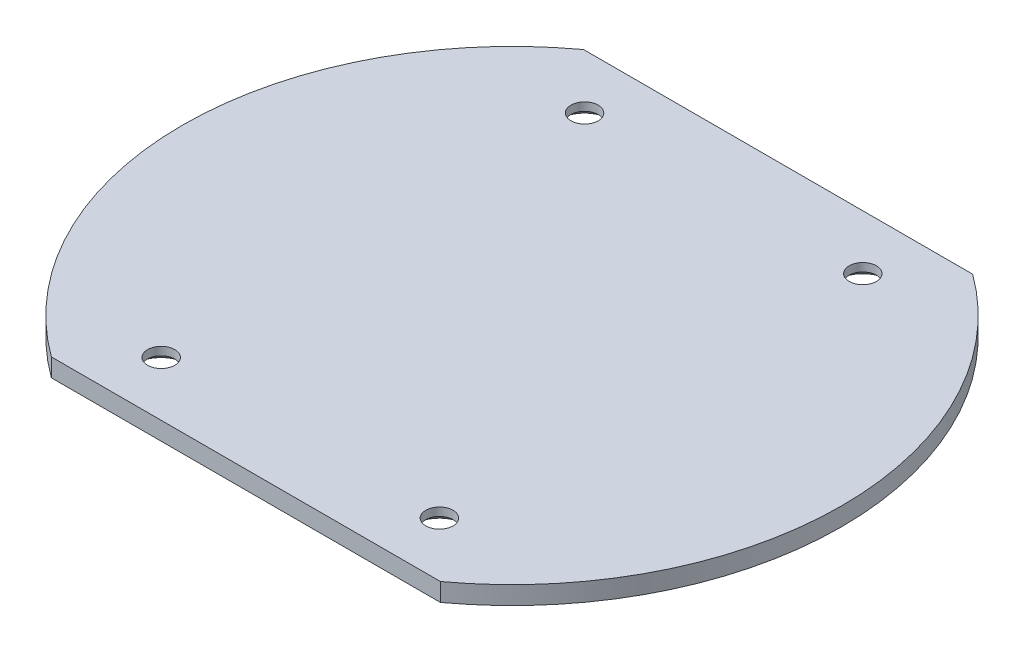
ISO-10303-21;
HEADER;
FILE_DESCRIPTION(('STEP AP214'),'2;1');
FILE_NAME('part.step','',(''),(''),'','','');
FILE_SCHEMA(('AUTOMOTIVE_DESIGN { 1 0 10303 214 1 1 1 1 }'));
ENDSEC;
DATA;
#1=APPLICATION_CONTEXT('core data for automotive mechanical design processes');
#2=APPLICATION_PROTOCOL_DEFINITION('international standard','automotive_design',2000,#1);
#3=PRODUCT_CONTEXT('',#1,'mechanical');
#4=PRODUCT('Part','Part','',(#3));
#5=PRODUCT_RELATED_PRODUCT_CATEGORY('part','',(#4));
#6=PRODUCT_DEFINITION_FORMATION('','',#4);
#7=PRODUCT_DEFINITION_CONTEXT('part definition',#1,'design');
#8=PRODUCT_DEFINITION('design','',#6,#7);
#9=PRODUCT_DEFINITION_SHAPE('','',#8);
#10=(LENGTH_UNIT() NAMED_UNIT(*) SI_UNIT(.MILLI.,.METRE.));
#11=(NAMED_UNIT(*) PLANE_ANGLE_UNIT() SI_UNIT($,.RADIAN.));
#12=(NAMED_UNIT(*) SI_UNIT($,.STERADIAN.) SOLID_ANGLE_UNIT());
#13=UNCERTAINTY_MEASURE_WITH_UNIT(LENGTH_MEASURE(1.E-05),#10,'distance_accuracy_value','');
#14=(GEOMETRIC_REPRESENTATION_CONTEXT(3) GLOBAL_UNCERTAINTY_ASSIGNED_CONTEXT((#13)) GLOBAL_UNIT_ASSIGNED_CONTEXT((#10,
#11,#12)) REPRESENTATION_CONTEXT('',''));
#15=CARTESIAN_POINT('',(0.,0.,0.));
#16=DIRECTION('',(0.,0.,1.));
#17=DIRECTION('',(1.,0.,0.));
#18=AXIS2_PLACEMENT_3D('',#15,#16,#17);
#19=CARTESIAN_POINT('',(0.,3.,0.));
#20=DIRECTION('',(0.,1.,0.));
#21=DIRECTION('',(0.,0.,1.));
#22=AXIS2_PLACEMENT_3D('',#19,#20,#21);
#23=PLANE('',#22);
#24=CARTESIAN_POINT('',(-23.,3.,-35.));
#25=DIRECTION('',(0.,1.,0.));
#26=DIRECTION('',(0.,0.,1.));
#27=AXIS2_PLACEMENT_3D('',#24,#25,#26);
#28=CIRCLE('',#27,2.2479);
#29=CARTESIAN_POINT('',(-23.,3.,-32.7521));
#30=VERTEX_POINT('',#29);
#31=EDGE_CURVE('E113',#30,#30,#28,.T.);
#32=ORIENTED_EDGE('',*,*,#31,.F.);
#33=EDGE_LOOP('',(#32));
#34=FACE_BOUND('',#33,.T.);
#35=CARTESIAN_POINT('',(23.,3.,-35.));
#36=DIRECTION('',(0.,1.,0.));
#37=DIRECTION('',(0.,0.,1.));
#38=AXIS2_PLACEMENT_3D('',#35,#36,#37);
#39=CIRCLE('',#38,2.2479);
#40=CARTESIAN_POINT('',(23.,3.,-32.7521));
#41=VERTEX_POINT('',#40);
#42=EDGE_CURVE('E117',#41,#41,#39,.T.);
#43=ORIENTED_EDGE('',*,*,#42,.F.);
#44=EDGE_LOOP('',(#43));
#45=FACE_BOUND('',#44,.T.);
#46=CARTESIAN_POINT('',(23.,3.,35.));
#47=DIRECTION('',(0.,1.,0.));
#48=DIRECTION('',(0.,0.,1.));
#49=AXIS2_PLACEMENT_3D('',#46,#47,#48);
#50=CIRCLE('',#49,2.2479);
#51=CARTESIAN_POINT('',(23.,3.,37.2479));
#52=VERTEX_POINT('',#51);
#53=EDGE_CURVE('E46',#52,#52,#50,.T.);
#54=ORIENTED_EDGE('',*,*,#53,.F.);
#55=EDGE_LOOP('',(#54));
#56=FACE_BOUND('',#55,.T.);
#57=CARTESIAN_POINT('',(-23.,3.,35.));
#58=DIRECTION('',(0.,1.,0.));
#59=DIRECTION('',(0.,0.,1.));
#60=AXIS2_PLACEMENT_3D('',#57,#58,#59);
#61=CIRCLE('',#60,2.2479);
#62=CARTESIAN_POINT('',(-23.,3.,37.2479));
#63=VERTEX_POINT('',#62);
#64=EDGE_CURVE('E11',#63,#63,#61,.T.);
#65=ORIENTED_EDGE('',*,*,#64,.F.);
#66=EDGE_LOOP('',(#65));
#67=FACE_BOUND('',#66,.T.);
#68=DIRECTION('',(1.,0.,0.));
#69=VECTOR('',#68,1.);
#70=CARTESIAN_POINT('',(0.,3.,44.));
#71=LINE('',#70,#69);
#72=CARTESIAN_POINT('',(-32.159757461772,3.,44.));
#73=VERTEX_POINT('',#72);
#74=CARTESIAN_POINT('',(32.159757461772,3.,44.));
#75=VERTEX_POINT('',#74);
#76=EDGE_CURVE('E100',#73,#75,#71,.T.);
#77=ORIENTED_EDGE('',*,*,#76,.T.);
#78=CARTESIAN_POINT('',(0.,3.,0.));
#79=DIRECTION('',(0.,1.,0.));
#80=DIRECTION('',(0.,0.,1.));
#81=AXIS2_PLACEMENT_3D('',#78,#79,#80);
#82=CIRCLE('',#81,54.5);
#83=CARTESIAN_POINT('',(32.159757461772,3.,-44.));
#84=VERTEX_POINT('',#83);
#85=EDGE_CURVE('E134',#75,#84,#82,.T.);
#86=ORIENTED_EDGE('',*,*,#85,.T.);
#87=DIRECTION('',(-1.,0.,0.));
#88=VECTOR('',#87,1.);
#89=CARTESIAN_POINT('',(0.,3.,-44.));
#90=LINE('',#89,#88);
#91=CARTESIAN_POINT('',(-32.159757461772,3.,-44.));
#92=VERTEX_POINT('',#91);
#93=EDGE_CURVE('E139',#84,#92,#90,.T.);
#94=ORIENTED_EDGE('',*,*,#93,.T.);
#95=CARTESIAN_POINT('',(0.,3.,0.));
#96=DIRECTION('',(0.,1.,0.));
#97=DIRECTION('',(0.,0.,1.));
#98=AXIS2_PLACEMENT_3D('',#95,#96,#97);
#99=CIRCLE('',#98,54.5);
#100=EDGE_CURVE('E94',#92,#73,#99,.T.);
#101=ORIENTED_EDGE('',*,*,#100,.T.);
#102=EDGE_LOOP('',(#77,#86,#94,#101));
#103=FACE_BOUND('',#102,.T.);
#104=ADVANCED_FACE('F36',(#34,#45,#56,#67,#103),#23,.T.);
#105=CARTESIAN_POINT('',(0.,0.,0.));
#106=DIRECTION('',(0.,1.,0.));
#107=DIRECTION('',(0.,0.,1.));
#108=AXIS2_PLACEMENT_3D('',#105,#106,#107);
#109=PLANE('',#108);
#110=CARTESIAN_POINT('',(-23.,0.,35.));
#111=DIRECTION('',(0.,-1.,0.));
#112=DIRECTION('',(0.,0.,-1.));
#113=AXIS2_PLACEMENT_3D('',#110,#111,#112);
#114=CIRCLE('',#113,4.2164);
#115=CARTESIAN_POINT('',(-23.,0.,30.7836));
#116=VERTEX_POINT('',#115);
#117=EDGE_CURVE('E177',#116,#116,#114,.T.);
#118=ORIENTED_EDGE('',*,*,#117,.F.);
#119=EDGE_LOOP('',(#118));
#120=FACE_BOUND('',#119,.T.);
#121=CARTESIAN_POINT('',(23.,0.,35.));
#122=DIRECTION('',(0.,-1.,0.));
#123=DIRECTION('',(0.,0.,-1.));
#124=AXIS2_PLACEMENT_3D('',#121,#122,#123);
#125=CIRCLE('',#124,4.2164);
#126=CARTESIAN_POINT('',(23.,0.,30.7836));
#127=VERTEX_POINT('',#126);
#128=EDGE_CURVE('E157',#127,#127,#125,.T.);
#129=ORIENTED_EDGE('',*,*,#128,.F.);
#130=EDGE_LOOP('',(#129));
#131=FACE_BOUND('',#130,.T.);
#132=CARTESIAN_POINT('',(23.,0.,-35.));
#133=DIRECTION('',(0.,-1.,0.));
#134=DIRECTION('',(0.,0.,-1.));
#135=AXIS2_PLACEMENT_3D('',#132,#133,#134);
#136=CIRCLE('',#135,4.2164);
#137=CARTESIAN_POINT('',(23.,0.,-39.2164));
#138=VERTEX_POINT('',#137);
#139=EDGE_CURVE('E152',#138,#138,#136,.T.);
#140=ORIENTED_EDGE('',*,*,#139,.F.);
#141=EDGE_LOOP('',(#140));
#142=FACE_BOUND('',#141,.T.);
#143=CARTESIAN_POINT('',(-23.,0.,-35.));
#144=DIRECTION('',(0.,-1.,0.));
#145=DIRECTION('',(0.,0.,-1.));
#146=AXIS2_PLACEMENT_3D('',#143,#144,#145);
#147=CIRCLE('',#146,4.2164);
#148=CARTESIAN_POINT('',(-23.,0.,-39.2164));
#149=VERTEX_POINT('',#148);
#150=EDGE_CURVE('E147',#149,#149,#147,.T.);
#151=ORIENTED_EDGE('',*,*,#150,.F.);
#152=EDGE_LOOP('',(#151));
#153=FACE_BOUND('',#152,.T.);
#154=DIRECTION('',(-1.,0.,0.));
#155=VECTOR('',#154,1.);
#156=CARTESIAN_POINT('',(0.,0.,44.));
#157=LINE('',#156,#155);
#158=CARTESIAN_POINT('',(32.159757461772,0.,44.));
#159=VERTEX_POINT('',#158);
#160=CARTESIAN_POINT('',(-32.159757461772,0.,44.));
#161=VERTEX_POINT('',#160);
#162=EDGE_CURVE('E75',#159,#161,#157,.T.);
#163=ORIENTED_EDGE('',*,*,#162,.T.);
#164=CARTESIAN_POINT('',(0.,0.,0.));
#165=DIRECTION('',(0.,1.,0.));
#166=DIRECTION('',(0.,0.,1.));
#167=AXIS2_PLACEMENT_3D('',#164,#165,#166);
#168=CIRCLE('',#167,54.5);
#169=CARTESIAN_POINT('',(-32.159757461772,0.,-44.));
#170=VERTEX_POINT('',#169);
#171=EDGE_CURVE('E77',#161,#170,#168,.F.);
#172=ORIENTED_EDGE('',*,*,#171,.T.);
#173=DIRECTION('',(1.,0.,0.));
#174=VECTOR('',#173,1.);
#175=CARTESIAN_POINT('',(0.,0.,-44.));
#176=LINE('',#175,#174);
#177=CARTESIAN_POINT('',(32.159757461772,0.,-44.));
#178=VERTEX_POINT('',#177);
#179=EDGE_CURVE('E79',#170,#178,#176,.T.);
#180=ORIENTED_EDGE('',*,*,#179,.T.);
#181=CARTESIAN_POINT('',(0.,0.,0.));
#182=DIRECTION('',(0.,1.,0.));
#183=DIRECTION('',(0.,0.,1.));
#184=AXIS2_PLACEMENT_3D('',#181,#182,#183);
#185=CIRCLE('',#184,54.5);
#186=EDGE_CURVE('E54',#178,#159,#185,.F.);
#187=ORIENTED_EDGE('',*,*,#186,.T.);
#188=EDGE_LOOP('',(#163,#172,#180,#187));
#189=FACE_BOUND('',#188,.T.);
#190=ADVANCED_FACE('F38',(#120,#131,#142,#153,#189),#109,.F.);
#191=CARTESIAN_POINT('',(-23.,3.,35.));
#192=DIRECTION('',(0.,1.,0.));
#193=DIRECTION('',(0.,0.,1.));
#194=AXIS2_PLACEMENT_3D('',#191,#192,#193);
#195=CYLINDRICAL_SURFACE('',#194,2.2479);
#196=CARTESIAN_POINT('',(-23.,1.65176762397248,35.));
#197=DIRECTION('',(0.,-1.,0.));
#198=DIRECTION('',(0.,0.,-1.));
#199=AXIS2_PLACEMENT_3D('',#196,#197,#198);
#200=CIRCLE('',#199,2.2479);
#201=CARTESIAN_POINT('',(-23.,1.65176762397248,32.7521));
#202=VERTEX_POINT('',#201);
#203=EDGE_CURVE('E144',#202,#202,#200,.T.);
#204=ORIENTED_EDGE('',*,*,#203,.T.);
#205=EDGE_LOOP('',(#204));
#206=FACE_BOUND('',#205,.T.);
#207=ORIENTED_EDGE('',*,*,#64,.T.);
#208=EDGE_LOOP('',(#207));
#209=FACE_BOUND('',#208,.T.);
#210=ADVANCED_FACE('F186',(#206,#209),#195,.F.);
#211=CARTESIAN_POINT('',(23.,3.,35.));
#212=DIRECTION('',(0.,1.,0.));
#213=DIRECTION('',(0.,0.,1.));
#214=AXIS2_PLACEMENT_3D('',#211,#212,#213);
#215=CYLINDRICAL_SURFACE('',#214,2.2479);
#216=CARTESIAN_POINT('',(23.,1.65176762397248,35.));
#217=DIRECTION('',(0.,-1.,0.));
#218=DIRECTION('',(0.,0.,-1.));
#219=AXIS2_PLACEMENT_3D('',#216,#217,#218);
#220=CIRCLE('',#219,2.2479);
#221=CARTESIAN_POINT('',(23.,1.65176762397248,32.7521));
#222=VERTEX_POINT('',#221);
#223=EDGE_CURVE('E155',#222,#222,#220,.T.);
#224=ORIENTED_EDGE('',*,*,#223,.T.);
#225=EDGE_LOOP('',(#224));
#226=FACE_BOUND('',#225,.T.);
#227=ORIENTED_EDGE('',*,*,#53,.T.);
#228=EDGE_LOOP('',(#227));
#229=FACE_BOUND('',#228,.T.);
#230=ADVANCED_FACE('F124',(#226,#229),#215,.F.);
#231=CARTESIAN_POINT('',(23.,3.,-35.));
#232=DIRECTION('',(0.,1.,0.));
#233=DIRECTION('',(0.,0.,1.));
#234=AXIS2_PLACEMENT_3D('',#231,#232,#233);
#235=CYLINDRICAL_SURFACE('',#234,2.2479);
#236=CARTESIAN_POINT('',(23.,1.65176762397248,-35.));
#237=DIRECTION('',(0.,-1.,0.));
#238=DIRECTION('',(0.,0.,-1.));
#239=AXIS2_PLACEMENT_3D('',#236,#237,#238);
#240=CIRCLE('',#239,2.2479);
#241=CARTESIAN_POINT('',(23.,1.65176762397248,-37.2479));
#242=VERTEX_POINT('',#241);
#243=EDGE_CURVE('E150',#242,#242,#240,.T.);
#244=ORIENTED_EDGE('',*,*,#243,.T.);
#245=EDGE_LOOP('',(#244));
#246=FACE_BOUND('',#245,.T.);
#247=ORIENTED_EDGE('',*,*,#42,.T.);
#248=EDGE_LOOP('',(#247));
#249=FACE_BOUND('',#248,.T.);
#250=ADVANCED_FACE('F219',(#246,#249),#235,.F.);
#251=CARTESIAN_POINT('',(-23.,3.,-35.));
#252=DIRECTION('',(0.,1.,0.));
#253=DIRECTION('',(0.,0.,1.));
#254=AXIS2_PLACEMENT_3D('',#251,#252,#253);
#255=CYLINDRICAL_SURFACE('',#254,2.2479);
#256=CARTESIAN_POINT('',(-23.,1.65176762397248,-35.));
#257=DIRECTION('',(0.,-1.,0.));
#258=DIRECTION('',(0.,0.,-1.));
#259=AXIS2_PLACEMENT_3D('',#256,#257,#258);
#260=CIRCLE('',#259,2.2479);
#261=CARTESIAN_POINT('',(-23.,1.65176762397248,-37.2479));
#262=VERTEX_POINT('',#261);
#263=EDGE_CURVE('E110',#262,#262,#260,.T.);
#264=ORIENTED_EDGE('',*,*,#263,.T.);
#265=EDGE_LOOP('',(#264));
#266=FACE_BOUND('',#265,.T.);
#267=ORIENTED_EDGE('',*,*,#31,.T.);
#268=EDGE_LOOP('',(#267));
#269=FACE_BOUND('',#268,.T.);
#270=ADVANCED_FACE('F216',(#266,#269),#255,.F.);
#271=CARTESIAN_POINT('',(0.,-140.089257261219,44.));
#272=DIRECTION('',(0.,0.,1.));
#273=DIRECTION('',(1.,0.,0.));
#274=AXIS2_PLACEMENT_3D('',#271,#272,#273);
#275=PLANE('',#274);
#276=ORIENTED_EDGE('',*,*,#162,.F.);
#277=DIRECTION('',(0.,1.,0.));
#278=VECTOR('',#277,1.);
#279=CARTESIAN_POINT('',(32.159757461772,-140.089257261219,44.));
#280=LINE('',#279,#278);
#281=EDGE_CURVE('E103',#159,#75,#280,.T.);
#282=ORIENTED_EDGE('',*,*,#281,.T.);
#283=ORIENTED_EDGE('',*,*,#76,.F.);
#284=DIRECTION('',(0.,1.,0.));
#285=VECTOR('',#284,1.);
#286=CARTESIAN_POINT('',(-32.159757461772,-140.089257261219,44.));
#287=LINE('',#286,#285);
#288=EDGE_CURVE('E96',#161,#73,#287,.T.);
#289=ORIENTED_EDGE('',*,*,#288,.F.);
#290=EDGE_LOOP('',(#276,#282,#283,#289));
#291=FACE_BOUND('',#290,.T.);
#292=ADVANCED_FACE('F213',(#291),#275,.T.);
#293=CARTESIAN_POINT('',(0.,-140.089257261219,0.));
#294=DIRECTION('',(0.,1.,0.));
#295=DIRECTION('',(0.,0.,1.));
#296=AXIS2_PLACEMENT_3D('',#293,#294,#295);
#297=CYLINDRICAL_SURFACE('',#296,54.5);
#298=ORIENTED_EDGE('',*,*,#171,.F.);
#299=ORIENTED_EDGE('',*,*,#288,.T.);
#300=ORIENTED_EDGE('',*,*,#100,.F.);
#301=DIRECTION('',(0.,1.,0.));
#302=VECTOR('',#301,1.);
#303=CARTESIAN_POINT('',(-32.159757461772,-140.089257261219,-44.));
#304=LINE('',#303,#302);
#305=EDGE_CURVE('E87',#170,#92,#304,.T.);
#306=ORIENTED_EDGE('',*,*,#305,.F.);
#307=EDGE_LOOP('',(#298,#299,#300,#306));
#308=FACE_BOUND('',#307,.T.);
#309=ADVANCED_FACE('F92',(#308),#297,.T.);
#310=CARTESIAN_POINT('',(0.,-140.089257261219,-44.));
#311=DIRECTION('',(0.,0.,-1.));
#312=DIRECTION('',(-1.,0.,0.));
#313=AXIS2_PLACEMENT_3D('',#310,#311,#312);
#314=PLANE('',#313);
#315=ORIENTED_EDGE('',*,*,#179,.F.);
#316=ORIENTED_EDGE('',*,*,#305,.T.);
#317=ORIENTED_EDGE('',*,*,#93,.F.);
#318=DIRECTION('',(0.,1.,0.));
#319=VECTOR('',#318,1.);
#320=CARTESIAN_POINT('',(32.159757461772,-140.089257261219,-44.));
#321=LINE('',#320,#319);
#322=EDGE_CURVE('E72',#178,#84,#321,.T.);
#323=ORIENTED_EDGE('',*,*,#322,.F.);
#324=EDGE_LOOP('',(#315,#316,#317,#323));
#325=FACE_BOUND('',#324,.T.);
#326=ADVANCED_FACE('F86',(#325),#314,.T.);
#327=CARTESIAN_POINT('',(0.,-140.089257261219,0.));
#328=DIRECTION('',(0.,1.,0.));
#329=DIRECTION('',(0.,0.,1.));
#330=AXIS2_PLACEMENT_3D('',#327,#328,#329);
#331=CYLINDRICAL_SURFACE('',#330,54.5);
#332=ORIENTED_EDGE('',*,*,#186,.F.);
#333=ORIENTED_EDGE('',*,*,#322,.T.);
#334=ORIENTED_EDGE('',*,*,#85,.F.);
#335=ORIENTED_EDGE('',*,*,#281,.F.);
#336=EDGE_LOOP('',(#332,#333,#334,#335));
#337=FACE_BOUND('',#336,.T.);
#338=ADVANCED_FACE('F196',(#337),#331,.T.);
#339=CARTESIAN_POINT('',(-23.,0.,-35.));
#340=DIRECTION('',(0.,-1.,0.));
#341=DIRECTION('',(0.,0.,-1.));
#342=AXIS2_PLACEMENT_3D('',#339,#340,#341);
#343=CONICAL_SURFACE('',#342,4.2164,0.872664625997163);
#344=ORIENTED_EDGE('',*,*,#263,.F.);
#345=EDGE_LOOP('',(#344));
#346=FACE_BOUND('',#345,.T.);
#347=ORIENTED_EDGE('',*,*,#150,.T.);
#348=EDGE_LOOP('',(#347));
#349=FACE_BOUND('',#348,.T.);
#350=ADVANCED_FACE('F193',(#346,#349),#343,.F.);
#351=CARTESIAN_POINT('',(23.,0.,-35.));
#352=DIRECTION('',(0.,-1.,0.));
#353=DIRECTION('',(0.,0.,-1.));
#354=AXIS2_PLACEMENT_3D('',#351,#352,#353);
#355=CONICAL_SURFACE('',#354,4.2164,0.872664625997163);
#356=ORIENTED_EDGE('',*,*,#243,.F.);
#357=EDGE_LOOP('',(#356));
#358=FACE_BOUND('',#357,.T.);
#359=ORIENTED_EDGE('',*,*,#139,.T.);
#360=EDGE_LOOP('',(#359));
#361=FACE_BOUND('',#360,.T.);
#362=ADVANCED_FACE('F195',(#358,#361),#355,.F.);
#363=CARTESIAN_POINT('',(23.,0.,35.));
#364=DIRECTION('',(0.,-1.,0.));
#365=DIRECTION('',(0.,0.,-1.));
#366=AXIS2_PLACEMENT_3D('',#363,#364,#365);
#367=CONICAL_SURFACE('',#366,4.2164,0.872664625997163);
#368=ORIENTED_EDGE('',*,*,#223,.F.);
#369=EDGE_LOOP('',(#368));
#370=FACE_BOUND('',#369,.T.);
#371=ORIENTED_EDGE('',*,*,#128,.T.);
#372=EDGE_LOOP('',(#371));
#373=FACE_BOUND('',#372,.T.);
#374=ADVANCED_FACE('F203',(#370,#373),#367,.F.);
#375=CARTESIAN_POINT('',(-23.,0.,35.));
#376=DIRECTION('',(0.,-1.,0.));
#377=DIRECTION('',(0.,0.,-1.));
#378=AXIS2_PLACEMENT_3D('',#375,#376,#377);
#379=CONICAL_SURFACE('',#378,4.2164,0.872664625997163);
#380=ORIENTED_EDGE('',*,*,#203,.F.);
#381=EDGE_LOOP('',(#380));
#382=FACE_BOUND('',#381,.T.);
#383=ORIENTED_EDGE('',*,*,#117,.T.);
#384=EDGE_LOOP('',(#383));
#385=FACE_BOUND('',#384,.T.);
#386=ADVANCED_FACE('F182',(#382,#385),#379,.F.);
#387=CLOSED_SHELL('',(#104,#190,#210,#230,#250,#270,#292,#309,#326,#338,#350,#362,#374,#386));
#388=MANIFOLD_SOLID_BREP('B2',#387);
#389=ADVANCED_BREP_SHAPE_REPRESENTATION('',(#18,#388),#14);
#390=SHAPE_DEFINITION_REPRESENTATION(#9,#389);
ENDSEC;
END-ISO-10303-21;
